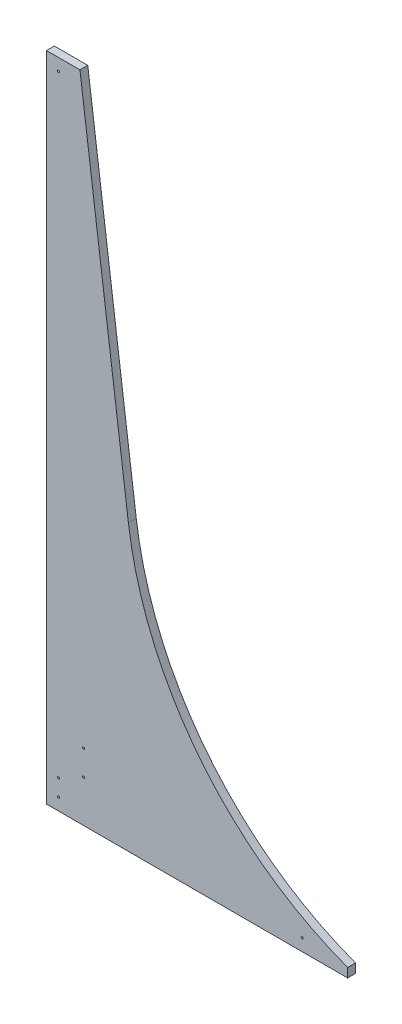
ISO-10303-21;
HEADER;
FILE_DESCRIPTION(('STEP AP214'),'2;1');
FILE_NAME('part.step','',(''),(''),'','','');
FILE_SCHEMA(('AUTOMOTIVE_DESIGN { 1 0 10303 214 1 1 1 1 }'));
ENDSEC;
DATA;
#1=APPLICATION_CONTEXT('core data for automotive mechanical design processes');
#2=APPLICATION_PROTOCOL_DEFINITION('international standard','automotive_design',2000,#1);
#3=PRODUCT_CONTEXT('',#1,'mechanical');
#4=PRODUCT('Part','Part','',(#3));
#5=PRODUCT_RELATED_PRODUCT_CATEGORY('part','',(#4));
#6=PRODUCT_DEFINITION_FORMATION('','',#4);
#7=PRODUCT_DEFINITION_CONTEXT('part definition',#1,'design');
#8=PRODUCT_DEFINITION('design','',#6,#7);
#9=PRODUCT_DEFINITION_SHAPE('','',#8);
#10=(LENGTH_UNIT() NAMED_UNIT(*) SI_UNIT(.MILLI.,.METRE.));
#11=(NAMED_UNIT(*) PLANE_ANGLE_UNIT() SI_UNIT($,.RADIAN.));
#12=(NAMED_UNIT(*) SI_UNIT($,.STERADIAN.) SOLID_ANGLE_UNIT());
#13=UNCERTAINTY_MEASURE_WITH_UNIT(LENGTH_MEASURE(1.E-05),#10,'distance_accuracy_value','');
#14=(GEOMETRIC_REPRESENTATION_CONTEXT(3) GLOBAL_UNCERTAINTY_ASSIGNED_CONTEXT((#13)) GLOBAL_UNIT_ASSIGNED_CONTEXT((#10,
#11,#12)) REPRESENTATION_CONTEXT('',''));
#15=CARTESIAN_POINT('',(0.,0.,0.));
#16=DIRECTION('',(0.,0.,1.));
#17=DIRECTION('',(1.,0.,0.));
#18=AXIS2_PLACEMENT_3D('',#15,#16,#17);
#19=CARTESIAN_POINT('',(638.116559349375,499.436357901165,11.90625));
#20=DIRECTION('',(0.,0.,-1.));
#21=DIRECTION('',(-1.,0.,0.));
#22=AXIS2_PLACEMENT_3D('',#19,#20,#21);
#23=CYLINDRICAL_SURFACE('',#22,518.182264806593);
#24=CARTESIAN_POINT('',(638.116559349375,499.436357901165,0.));
#25=DIRECTION('',(0.,0.,1.));
#26=DIRECTION('',(1.,0.,0.));
#27=AXIS2_PLACEMENT_3D('',#24,#25,#26);
#28=CIRCLE('',#27,518.182264806593);
#29=CARTESIAN_POINT('',(124.367415651835,431.8,0.));
#30=VERTEX_POINT('',#29);
#31=CARTESIAN_POINT('',(457.201,13.8620382080899,0.));
#32=VERTEX_POINT('',#31);
#33=EDGE_CURVE('E157',#30,#32,#28,.T.);
#34=ORIENTED_EDGE('',*,*,#33,.F.);
#35=DIRECTION('',(0.,0.,-1.));
#36=VECTOR('',#35,1.);
#37=CARTESIAN_POINT('',(124.367415651835,431.8,11.90625));
#38=LINE('',#37,#36);
#39=CARTESIAN_POINT('',(124.367415651835,431.8,11.90625));
#40=VERTEX_POINT('',#39);
#41=EDGE_CURVE('E11',#40,#30,#38,.T.);
#42=ORIENTED_EDGE('',*,*,#41,.F.);
#43=CARTESIAN_POINT('',(638.116559349375,499.436357901165,11.90625));
#44=DIRECTION('',(0.,0.,1.));
#45=DIRECTION('',(1.,0.,0.));
#46=AXIS2_PLACEMENT_3D('',#43,#44,#45);
#47=CIRCLE('',#46,518.182264806593);
#48=CARTESIAN_POINT('',(457.201,13.8620382080899,11.90625));
#49=VERTEX_POINT('',#48);
#50=EDGE_CURVE('E201',#40,#49,#47,.T.);
#51=ORIENTED_EDGE('',*,*,#50,.T.);
#52=DIRECTION('',(0.,0.,-1.));
#53=VECTOR('',#52,1.);
#54=CARTESIAN_POINT('',(457.201,13.8620382080899,11.90625));
#55=LINE('',#54,#53);
#56=EDGE_CURVE('E60',#49,#32,#55,.T.);
#57=ORIENTED_EDGE('',*,*,#56,.T.);
#58=EDGE_LOOP('',(#34,#42,#51,#57));
#59=FACE_BOUND('',#58,.T.);
#60=ADVANCED_FACE('F43',(#59),#23,.F.);
#61=CARTESIAN_POINT('',(178.127589027018,23.4509419846275,11.90625));
#62=DIRECTION('',(0.991444861373811,0.130526192220048,0.));
#63=DIRECTION('',(-0.130526192220048,0.991444861373811,0.));
#64=AXIS2_PLACEMENT_3D('',#61,#62,#63);
#65=PLANE('',#64);
#66=DIRECTION('',(0.130526192220048,-0.991444861373811,0.));
#67=VECTOR('',#66,1.);
#68=CARTESIAN_POINT('',(178.127589027018,23.4509419846275,0.));
#69=LINE('',#68,#67);
#70=CARTESIAN_POINT('',(50.8,990.6,0.));
#71=VERTEX_POINT('',#70);
#72=EDGE_CURVE('E160',#71,#30,#69,.T.);
#73=ORIENTED_EDGE('',*,*,#72,.F.);
#74=DIRECTION('',(0.,0.,-1.));
#75=VECTOR('',#74,1.);
#76=CARTESIAN_POINT('',(50.8,990.6,11.90625));
#77=LINE('',#76,#75);
#78=CARTESIAN_POINT('',(50.8,990.6,11.90625));
#79=VERTEX_POINT('',#78);
#80=EDGE_CURVE('E52',#79,#71,#77,.T.);
#81=ORIENTED_EDGE('',*,*,#80,.F.);
#82=DIRECTION('',(0.130526192220048,-0.991444861373811,0.));
#83=VECTOR('',#82,1.);
#84=CARTESIAN_POINT('',(178.127589027018,23.4509419846275,11.90625));
#85=LINE('',#84,#83);
#86=EDGE_CURVE('E127',#79,#40,#85,.T.);
#87=ORIENTED_EDGE('',*,*,#86,.T.);
#88=ORIENTED_EDGE('',*,*,#41,.T.);
#89=EDGE_LOOP('',(#73,#81,#87,#88));
#90=FACE_BOUND('',#89,.T.);
#91=ADVANCED_FACE('F214',(#90),#65,.T.);
#92=CARTESIAN_POINT('',(0.,990.6,11.90625));
#93=DIRECTION('',(0.,1.,0.));
#94=DIRECTION('',(0.,0.,1.));
#95=AXIS2_PLACEMENT_3D('',#92,#93,#94);
#96=PLANE('',#95);
#97=DIRECTION('',(1.,0.,0.));
#98=VECTOR('',#97,1.);
#99=CARTESIAN_POINT('',(0.,990.6,0.));
#100=LINE('',#99,#98);
#101=CARTESIAN_POINT('',(0.,990.6,0.));
#102=VERTEX_POINT('',#101);
#103=EDGE_CURVE('E164',#102,#71,#100,.T.);
#104=ORIENTED_EDGE('',*,*,#103,.F.);
#105=DIRECTION('',(0.,0.,-1.));
#106=VECTOR('',#105,1.);
#107=CARTESIAN_POINT('',(0.,990.6,11.90625));
#108=LINE('',#107,#106);
#109=CARTESIAN_POINT('',(0.,990.6,11.90625));
#110=VERTEX_POINT('',#109);
#111=EDGE_CURVE('E109',#110,#102,#108,.T.);
#112=ORIENTED_EDGE('',*,*,#111,.F.);
#113=DIRECTION('',(1.,0.,0.));
#114=VECTOR('',#113,1.);
#115=CARTESIAN_POINT('',(0.,990.6,11.90625));
#116=LINE('',#115,#114);
#117=EDGE_CURVE('E123',#110,#79,#116,.T.);
#118=ORIENTED_EDGE('',*,*,#117,.T.);
#119=ORIENTED_EDGE('',*,*,#80,.T.);
#120=EDGE_LOOP('',(#104,#112,#118,#119));
#121=FACE_BOUND('',#120,.T.);
#122=ADVANCED_FACE('F211',(#121),#96,.T.);
#123=CARTESIAN_POINT('',(0.,0.,11.90625));
#124=DIRECTION('',(-1.,0.,0.));
#125=DIRECTION('',(0.,0.,1.));
#126=AXIS2_PLACEMENT_3D('',#123,#124,#125);
#127=PLANE('',#126);
#128=DIRECTION('',(0.,1.,0.));
#129=VECTOR('',#128,1.);
#130=CARTESIAN_POINT('',(0.,0.,0.));
#131=LINE('',#130,#129);
#132=CARTESIAN_POINT('',(0.,0.,0.));
#133=VERTEX_POINT('',#132);
#134=EDGE_CURVE('E105',#133,#102,#131,.T.);
#135=ORIENTED_EDGE('',*,*,#134,.F.);
#136=DIRECTION('',(0.,0.,-1.));
#137=VECTOR('',#136,1.);
#138=CARTESIAN_POINT('',(0.,0.,11.90625));
#139=LINE('',#138,#137);
#140=CARTESIAN_POINT('',(0.,0.,11.90625));
#141=VERTEX_POINT('',#140);
#142=EDGE_CURVE('E99',#141,#133,#139,.T.);
#143=ORIENTED_EDGE('',*,*,#142,.F.);
#144=DIRECTION('',(0.,1.,0.));
#145=VECTOR('',#144,1.);
#146=CARTESIAN_POINT('',(0.,0.,11.90625));
#147=LINE('',#146,#145);
#148=EDGE_CURVE('E103',#141,#110,#147,.T.);
#149=ORIENTED_EDGE('',*,*,#148,.T.);
#150=ORIENTED_EDGE('',*,*,#111,.T.);
#151=EDGE_LOOP('',(#135,#143,#149,#150));
#152=FACE_BOUND('',#151,.T.);
#153=ADVANCED_FACE('F101',(#152),#127,.T.);
#154=CARTESIAN_POINT('',(0.,0.,11.90625));
#155=DIRECTION('',(0.,1.,0.));
#156=DIRECTION('',(0.,0.,1.));
#157=AXIS2_PLACEMENT_3D('',#154,#155,#156);
#158=PLANE('',#157);
#159=DIRECTION('',(1.,0.,0.));
#160=VECTOR('',#159,1.);
#161=CARTESIAN_POINT('',(0.,0.,0.));
#162=LINE('',#161,#160);
#163=CARTESIAN_POINT('',(457.201,0.,0.));
#164=VERTEX_POINT('',#163);
#165=EDGE_CURVE('E170',#133,#164,#162,.T.);
#166=ORIENTED_EDGE('',*,*,#165,.T.);
#167=DIRECTION('',(0.,0.,-1.));
#168=VECTOR('',#167,1.);
#169=CARTESIAN_POINT('',(457.201,0.,11.90625));
#170=LINE('',#169,#168);
#171=CARTESIAN_POINT('',(457.201,0.,11.90625));
#172=VERTEX_POINT('',#171);
#173=EDGE_CURVE('E80',#172,#164,#170,.T.);
#174=ORIENTED_EDGE('',*,*,#173,.F.);
#175=DIRECTION('',(1.,0.,0.));
#176=VECTOR('',#175,1.);
#177=CARTESIAN_POINT('',(0.,0.,11.90625));
#178=LINE('',#177,#176);
#179=EDGE_CURVE('E111',#141,#172,#178,.T.);
#180=ORIENTED_EDGE('',*,*,#179,.F.);
#181=ORIENTED_EDGE('',*,*,#142,.T.);
#182=EDGE_LOOP('',(#166,#174,#180,#181));
#183=FACE_BOUND('',#182,.T.);
#184=ADVANCED_FACE('F112',(#183),#158,.F.);
#185=CARTESIAN_POINT('',(388.14375,18.25625,11.90625));
#186=DIRECTION('',(0.,0.,-1.));
#187=DIRECTION('',(-1.,0.,0.));
#188=AXIS2_PLACEMENT_3D('',#185,#186,#187);
#189=CYLINDRICAL_SURFACE('',#188,1.58750000000004);
#190=CARTESIAN_POINT('',(388.14375,18.25625,11.90625));
#191=DIRECTION('',(0.,0.,1.));
#192=DIRECTION('',(1.,0.,0.));
#193=AXIS2_PLACEMENT_3D('',#190,#191,#192);
#194=CIRCLE('',#193,1.58750000000004);
#195=CARTESIAN_POINT('',(389.73125,18.25625,11.90625));
#196=VERTEX_POINT('',#195);
#197=EDGE_CURVE('E149',#196,#196,#194,.T.);
#198=ORIENTED_EDGE('',*,*,#197,.T.);
#199=EDGE_LOOP('',(#198));
#200=FACE_BOUND('',#199,.T.);
#201=CARTESIAN_POINT('',(388.14375,18.25625,0.));
#202=DIRECTION('',(0.,0.,1.));
#203=DIRECTION('',(1.,0.,0.));
#204=AXIS2_PLACEMENT_3D('',#201,#202,#203);
#205=CIRCLE('',#204,1.58750000000004);
#206=CARTESIAN_POINT('',(389.73125,18.25625,0.));
#207=VERTEX_POINT('',#206);
#208=EDGE_CURVE('E193',#207,#207,#205,.T.);
#209=ORIENTED_EDGE('',*,*,#208,.F.);
#210=EDGE_LOOP('',(#209));
#211=FACE_BOUND('',#210,.T.);
#212=ADVANCED_FACE('F244',(#200,#211),#189,.F.);
#213=CARTESIAN_POINT('',(18.25625,972.34375,11.90625));
#214=DIRECTION('',(0.,0.,-1.));
#215=DIRECTION('',(-1.,0.,0.));
#216=AXIS2_PLACEMENT_3D('',#213,#214,#215);
#217=CYLINDRICAL_SURFACE('',#216,1.58750000000001);
#218=CARTESIAN_POINT('',(18.25625,972.34375,11.90625));
#219=DIRECTION('',(0.,0.,1.));
#220=DIRECTION('',(1.,0.,0.));
#221=AXIS2_PLACEMENT_3D('',#218,#219,#220);
#222=CIRCLE('',#221,1.58750000000001);
#223=CARTESIAN_POINT('',(19.84375,972.34375,11.90625));
#224=VERTEX_POINT('',#223);
#225=EDGE_CURVE('E145',#224,#224,#222,.T.);
#226=ORIENTED_EDGE('',*,*,#225,.T.);
#227=EDGE_LOOP('',(#226));
#228=FACE_BOUND('',#227,.T.);
#229=CARTESIAN_POINT('',(18.25625,972.34375,0.));
#230=DIRECTION('',(0.,0.,1.));
#231=DIRECTION('',(1.,0.,0.));
#232=AXIS2_PLACEMENT_3D('',#229,#230,#231);
#233=CIRCLE('',#232,1.58750000000001);
#234=CARTESIAN_POINT('',(19.84375,972.34375,0.));
#235=VERTEX_POINT('',#234);
#236=EDGE_CURVE('E189',#235,#235,#233,.T.);
#237=ORIENTED_EDGE('',*,*,#236,.F.);
#238=EDGE_LOOP('',(#237));
#239=FACE_BOUND('',#238,.T.);
#240=ADVANCED_FACE('F248',(#228,#239),#217,.F.);
#241=CARTESIAN_POINT('',(56.35625,101.6,11.90625));
#242=DIRECTION('',(0.,0.,-1.));
#243=DIRECTION('',(-1.,0.,0.));
#244=AXIS2_PLACEMENT_3D('',#241,#242,#243);
#245=CYLINDRICAL_SURFACE('',#244,1.5875);
#246=CARTESIAN_POINT('',(56.35625,101.6,11.90625));
#247=DIRECTION('',(0.,0.,1.));
#248=DIRECTION('',(1.,0.,0.));
#249=AXIS2_PLACEMENT_3D('',#246,#247,#248);
#250=CIRCLE('',#249,1.5875);
#251=CARTESIAN_POINT('',(57.94375,101.6,11.90625));
#252=VERTEX_POINT('',#251);
#253=EDGE_CURVE('E141',#252,#252,#250,.T.);
#254=ORIENTED_EDGE('',*,*,#253,.T.);
#255=EDGE_LOOP('',(#254));
#256=FACE_BOUND('',#255,.T.);
#257=CARTESIAN_POINT('',(56.35625,101.6,0.));
#258=DIRECTION('',(0.,0.,1.));
#259=DIRECTION('',(1.,0.,0.));
#260=AXIS2_PLACEMENT_3D('',#257,#258,#259);
#261=CIRCLE('',#260,1.5875);
#262=CARTESIAN_POINT('',(57.94375,101.6,0.));
#263=VERTEX_POINT('',#262);
#264=EDGE_CURVE('E185',#263,#263,#261,.T.);
#265=ORIENTED_EDGE('',*,*,#264,.F.);
#266=EDGE_LOOP('',(#265));
#267=FACE_BOUND('',#266,.T.);
#268=ADVANCED_FACE('F254',(#256,#267),#245,.F.);
#269=CARTESIAN_POINT('',(18.25625,43.65625,11.90625));
#270=DIRECTION('',(0.,0.,-1.));
#271=DIRECTION('',(-1.,0.,0.));
#272=AXIS2_PLACEMENT_3D('',#269,#270,#271);
#273=CYLINDRICAL_SURFACE('',#272,1.5875);
#274=CARTESIAN_POINT('',(18.25625,43.65625,11.90625));
#275=DIRECTION('',(0.,0.,1.));
#276=DIRECTION('',(1.,0.,0.));
#277=AXIS2_PLACEMENT_3D('',#274,#275,#276);
#278=CIRCLE('',#277,1.5875);
#279=CARTESIAN_POINT('',(19.84375,43.65625,11.90625));
#280=VERTEX_POINT('',#279);
#281=EDGE_CURVE('E137',#280,#280,#278,.T.);
#282=ORIENTED_EDGE('',*,*,#281,.T.);
#283=EDGE_LOOP('',(#282));
#284=FACE_BOUND('',#283,.T.);
#285=CARTESIAN_POINT('',(18.25625,43.65625,0.));
#286=DIRECTION('',(0.,0.,1.));
#287=DIRECTION('',(1.,0.,0.));
#288=AXIS2_PLACEMENT_3D('',#285,#286,#287);
#289=CIRCLE('',#288,1.5875);
#290=CARTESIAN_POINT('',(19.84375,43.65625,0.));
#291=VERTEX_POINT('',#290);
#292=EDGE_CURVE('E181',#291,#291,#289,.T.);
#293=ORIENTED_EDGE('',*,*,#292,.F.);
#294=EDGE_LOOP('',(#293));
#295=FACE_BOUND('',#294,.T.);
#296=ADVANCED_FACE('F229',(#284,#295),#273,.F.);
#297=CARTESIAN_POINT('',(56.35625,63.5,11.90625));
#298=DIRECTION('',(0.,0.,-1.));
#299=DIRECTION('',(-1.,0.,0.));
#300=AXIS2_PLACEMENT_3D('',#297,#298,#299);
#301=CYLINDRICAL_SURFACE('',#300,1.5875);
#302=CARTESIAN_POINT('',(56.35625,63.5,11.90625));
#303=DIRECTION('',(0.,0.,1.));
#304=DIRECTION('',(1.,0.,0.));
#305=AXIS2_PLACEMENT_3D('',#302,#303,#304);
#306=CIRCLE('',#305,1.5875);
#307=CARTESIAN_POINT('',(57.94375,63.5,11.90625));
#308=VERTEX_POINT('',#307);
#309=EDGE_CURVE('E133',#308,#308,#306,.T.);
#310=ORIENTED_EDGE('',*,*,#309,.T.);
#311=EDGE_LOOP('',(#310));
#312=FACE_BOUND('',#311,.T.);
#313=CARTESIAN_POINT('',(56.35625,63.5,0.));
#314=DIRECTION('',(0.,0.,1.));
#315=DIRECTION('',(1.,0.,0.));
#316=AXIS2_PLACEMENT_3D('',#313,#314,#315);
#317=CIRCLE('',#316,1.5875);
#318=CARTESIAN_POINT('',(57.94375,63.5,0.));
#319=VERTEX_POINT('',#318);
#320=EDGE_CURVE('E177',#319,#319,#317,.T.);
#321=ORIENTED_EDGE('',*,*,#320,.F.);
#322=EDGE_LOOP('',(#321));
#323=FACE_BOUND('',#322,.T.);
#324=ADVANCED_FACE('F221',(#312,#323),#301,.F.);
#325=CARTESIAN_POINT('',(457.201,0.,11.90625));
#326=DIRECTION('',(1.,0.,0.));
#327=DIRECTION('',(0.,0.,-1.));
#328=AXIS2_PLACEMENT_3D('',#325,#326,#327);
#329=PLANE('',#328);
#330=DIRECTION('',(0.,-1.,0.));
#331=VECTOR('',#330,1.);
#332=CARTESIAN_POINT('',(457.201,0.,0.));
#333=LINE('',#332,#331);
#334=EDGE_CURVE('E173',#32,#164,#333,.T.);
#335=ORIENTED_EDGE('',*,*,#334,.F.);
#336=ORIENTED_EDGE('',*,*,#56,.F.);
#337=DIRECTION('',(0.,-1.,0.));
#338=VECTOR('',#337,1.);
#339=CARTESIAN_POINT('',(457.201,0.,11.90625));
#340=LINE('',#339,#338);
#341=EDGE_CURVE('E116',#49,#172,#340,.T.);
#342=ORIENTED_EDGE('',*,*,#341,.T.);
#343=ORIENTED_EDGE('',*,*,#173,.T.);
#344=EDGE_LOOP('',(#335,#336,#342,#343));
#345=FACE_BOUND('',#344,.T.);
#346=ADVANCED_FACE('F218',(#345),#329,.T.);
#347=CARTESIAN_POINT('',(18.25625,18.25625,11.90625));
#348=DIRECTION('',(0.,0.,-1.));
#349=DIRECTION('',(-1.,0.,0.));
#350=AXIS2_PLACEMENT_3D('',#347,#348,#349);
#351=CYLINDRICAL_SURFACE('',#350,1.5875);
#352=CARTESIAN_POINT('',(18.25625,18.25625,11.90625));
#353=DIRECTION('',(0.,0.,1.));
#354=DIRECTION('',(1.,0.,0.));
#355=AXIS2_PLACEMENT_3D('',#352,#353,#354);
#356=CIRCLE('',#355,1.5875);
#357=CARTESIAN_POINT('',(19.84375,18.25625,11.90625));
#358=VERTEX_POINT('',#357);
#359=EDGE_CURVE('E153',#358,#358,#356,.T.);
#360=ORIENTED_EDGE('',*,*,#359,.T.);
#361=EDGE_LOOP('',(#360));
#362=FACE_BOUND('',#361,.T.);
#363=CARTESIAN_POINT('',(18.25625,18.25625,0.));
#364=DIRECTION('',(0.,0.,1.));
#365=DIRECTION('',(1.,0.,0.));
#366=AXIS2_PLACEMENT_3D('',#363,#364,#365);
#367=CIRCLE('',#366,1.5875);
#368=CARTESIAN_POINT('',(19.84375,18.25625,0.));
#369=VERTEX_POINT('',#368);
#370=EDGE_CURVE('E197',#369,#369,#367,.T.);
#371=ORIENTED_EDGE('',*,*,#370,.F.);
#372=EDGE_LOOP('',(#371));
#373=FACE_BOUND('',#372,.T.);
#374=ADVANCED_FACE('F220',(#362,#373),#351,.F.);
#375=CARTESIAN_POINT('',(0.,0.,11.90625));
#376=DIRECTION('',(0.,0.,1.));
#377=DIRECTION('',(1.,0.,0.));
#378=AXIS2_PLACEMENT_3D('',#375,#376,#377);
#379=PLANE('',#378);
#380=ORIENTED_EDGE('',*,*,#50,.F.);
#381=ORIENTED_EDGE('',*,*,#86,.F.);
#382=ORIENTED_EDGE('',*,*,#117,.F.);
#383=ORIENTED_EDGE('',*,*,#148,.F.);
#384=ORIENTED_EDGE('',*,*,#179,.T.);
#385=ORIENTED_EDGE('',*,*,#341,.F.);
#386=EDGE_LOOP('',(#380,#381,#382,#383,#384,#385));
#387=FACE_BOUND('',#386,.T.);
#388=ORIENTED_EDGE('',*,*,#309,.F.);
#389=EDGE_LOOP('',(#388));
#390=FACE_BOUND('',#389,.T.);
#391=ORIENTED_EDGE('',*,*,#281,.F.);
#392=EDGE_LOOP('',(#391));
#393=FACE_BOUND('',#392,.T.);
#394=ORIENTED_EDGE('',*,*,#253,.F.);
#395=EDGE_LOOP('',(#394));
#396=FACE_BOUND('',#395,.T.);
#397=ORIENTED_EDGE('',*,*,#225,.F.);
#398=EDGE_LOOP('',(#397));
#399=FACE_BOUND('',#398,.T.);
#400=ORIENTED_EDGE('',*,*,#197,.F.);
#401=EDGE_LOOP('',(#400));
#402=FACE_BOUND('',#401,.T.);
#403=ORIENTED_EDGE('',*,*,#359,.F.);
#404=EDGE_LOOP('',(#403));
#405=FACE_BOUND('',#404,.T.);
#406=ADVANCED_FACE('F119',(#387,#390,#393,#396,#399,#402,#405),#379,.T.);
#407=CARTESIAN_POINT('',(0.,0.,0.));
#408=DIRECTION('',(0.,0.,1.));
#409=DIRECTION('',(1.,0.,0.));
#410=AXIS2_PLACEMENT_3D('',#407,#408,#409);
#411=PLANE('',#410);
#412=ORIENTED_EDGE('',*,*,#33,.T.);
#413=ORIENTED_EDGE('',*,*,#334,.T.);
#414=ORIENTED_EDGE('',*,*,#165,.F.);
#415=ORIENTED_EDGE('',*,*,#134,.T.);
#416=ORIENTED_EDGE('',*,*,#103,.T.);
#417=ORIENTED_EDGE('',*,*,#72,.T.);
#418=EDGE_LOOP('',(#412,#413,#414,#415,#416,#417));
#419=FACE_BOUND('',#418,.T.);
#420=ORIENTED_EDGE('',*,*,#320,.T.);
#421=EDGE_LOOP('',(#420));
#422=FACE_BOUND('',#421,.T.);
#423=ORIENTED_EDGE('',*,*,#292,.T.);
#424=EDGE_LOOP('',(#423));
#425=FACE_BOUND('',#424,.T.);
#426=ORIENTED_EDGE('',*,*,#264,.T.);
#427=EDGE_LOOP('',(#426));
#428=FACE_BOUND('',#427,.T.);
#429=ORIENTED_EDGE('',*,*,#236,.T.);
#430=EDGE_LOOP('',(#429));
#431=FACE_BOUND('',#430,.T.);
#432=ORIENTED_EDGE('',*,*,#208,.T.);
#433=EDGE_LOOP('',(#432));
#434=FACE_BOUND('',#433,.T.);
#435=ORIENTED_EDGE('',*,*,#370,.T.);
#436=EDGE_LOOP('',(#435));
#437=FACE_BOUND('',#436,.T.);
#438=ADVANCED_FACE('F216',(#419,#422,#425,#428,#431,#434,#437),#411,.F.);
#439=CLOSED_SHELL('',(#60,#91,#122,#153,#184,#212,#240,#268,#296,#324,#346,#374,#406,#438));
#440=MANIFOLD_SOLID_BREP('B2',#439);
#441=ADVANCED_BREP_SHAPE_REPRESENTATION('',(#18,#440),#14);
#442=SHAPE_DEFINITION_REPRESENTATION(#9,#441);
ENDSEC;
END-ISO-10303-21;
